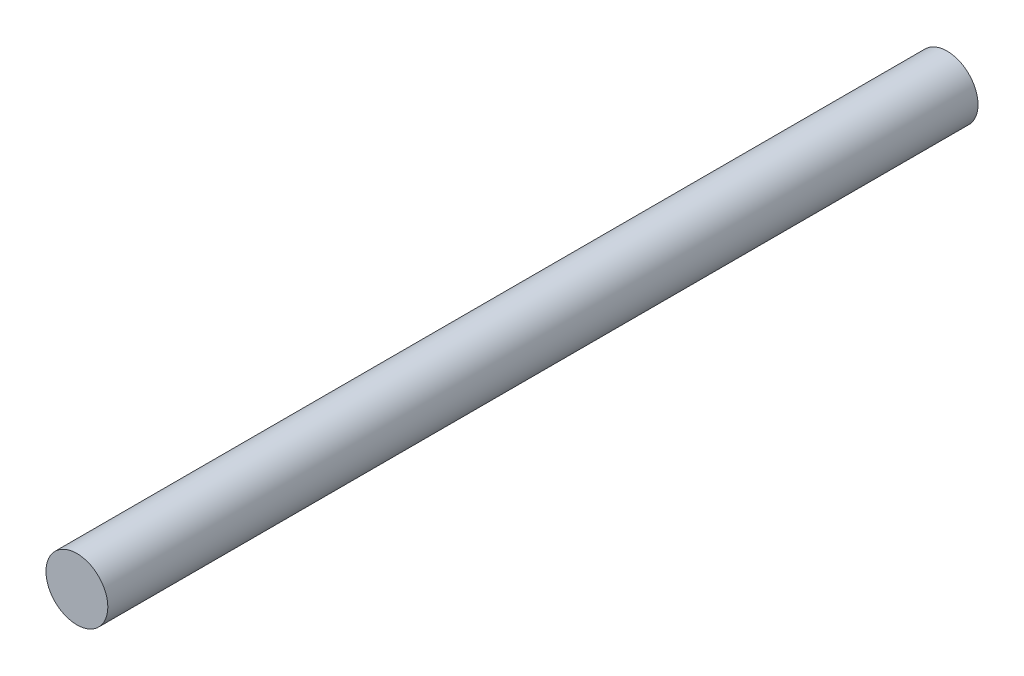
ISO-10303-21;
HEADER;
FILE_DESCRIPTION(('STEP AP214'),'2;1');
FILE_NAME('part.step','',(''),(''),'','','');
FILE_SCHEMA(('AUTOMOTIVE_DESIGN { 1 0 10303 214 1 1 1 1 }'));
ENDSEC;
DATA;
#1=APPLICATION_CONTEXT('core data for automotive mechanical design processes');
#2=APPLICATION_PROTOCOL_DEFINITION('international standard','automotive_design',2000,#1);
#3=PRODUCT_CONTEXT('',#1,'mechanical');
#4=PRODUCT('Part','Part','',(#3));
#5=PRODUCT_RELATED_PRODUCT_CATEGORY('part','',(#4));
#6=PRODUCT_DEFINITION_FORMATION('','',#4);
#7=PRODUCT_DEFINITION_CONTEXT('part definition',#1,'design');
#8=PRODUCT_DEFINITION('design','',#6,#7);
#9=PRODUCT_DEFINITION_SHAPE('','',#8);
#10=(LENGTH_UNIT() NAMED_UNIT(*) SI_UNIT(.MILLI.,.METRE.));
#11=(NAMED_UNIT(*) PLANE_ANGLE_UNIT() SI_UNIT($,.RADIAN.));
#12=(NAMED_UNIT(*) SI_UNIT($,.STERADIAN.) SOLID_ANGLE_UNIT());
#13=UNCERTAINTY_MEASURE_WITH_UNIT(LENGTH_MEASURE(1.E-05),#10,'distance_accuracy_value','');
#14=(GEOMETRIC_REPRESENTATION_CONTEXT(3) GLOBAL_UNCERTAINTY_ASSIGNED_CONTEXT((#13)) GLOBAL_UNIT_ASSIGNED_CONTEXT((#10,
#11,#12)) REPRESENTATION_CONTEXT('',''));
#15=CARTESIAN_POINT('',(0.,0.,0.));
#16=DIRECTION('',(0.,0.,1.));
#17=DIRECTION('',(1.,0.,0.));
#18=AXIS2_PLACEMENT_3D('',#15,#16,#17);
#19=CARTESIAN_POINT('',(0.,0.,45.));
#20=DIRECTION('',(0.,0.,-1.));
#21=DIRECTION('',(-1.,0.,0.));
#22=AXIS2_PLACEMENT_3D('',#19,#20,#21);
#23=CYLINDRICAL_SURFACE('',#22,1.6);
#24=CARTESIAN_POINT('',(0.,0.,45.));
#25=DIRECTION('',(0.,0.,1.));
#26=DIRECTION('',(1.,0.,0.));
#27=AXIS2_PLACEMENT_3D('',#24,#25,#26);
#28=CIRCLE('',#27,1.6);
#29=CARTESIAN_POINT('',(1.6,0.,45.));
#30=VERTEX_POINT('',#29);
#31=EDGE_CURVE('E10',#30,#30,#28,.T.);
#32=ORIENTED_EDGE('',*,*,#31,.F.);
#33=EDGE_LOOP('',(#32));
#34=FACE_BOUND('',#33,.T.);
#35=CARTESIAN_POINT('',(0.,0.,0.));
#36=DIRECTION('',(0.,0.,1.));
#37=DIRECTION('',(1.,0.,0.));
#38=AXIS2_PLACEMENT_3D('',#35,#36,#37);
#39=CIRCLE('',#38,1.6);
#40=CARTESIAN_POINT('',(1.6,0.,0.));
#41=VERTEX_POINT('',#40);
#42=EDGE_CURVE('E34',#41,#41,#39,.T.);
#43=ORIENTED_EDGE('',*,*,#42,.T.);
#44=EDGE_LOOP('',(#43));
#45=FACE_BOUND('',#44,.T.);
#46=ADVANCED_FACE('F31',(#34,#45),#23,.T.);
#47=CARTESIAN_POINT('',(0.,0.,45.));
#48=DIRECTION('',(0.,0.,1.));
#49=DIRECTION('',(1.,0.,0.));
#50=AXIS2_PLACEMENT_3D('',#47,#48,#49);
#51=PLANE('',#50);
#52=ORIENTED_EDGE('',*,*,#31,.T.);
#53=EDGE_LOOP('',(#52));
#54=FACE_BOUND('',#53,.T.);
#55=ADVANCED_FACE('F46',(#54),#51,.T.);
#56=CARTESIAN_POINT('',(0.,0.,0.));
#57=DIRECTION('',(0.,0.,1.));
#58=DIRECTION('',(1.,0.,0.));
#59=AXIS2_PLACEMENT_3D('',#56,#57,#58);
#60=PLANE('',#59);
#61=ORIENTED_EDGE('',*,*,#42,.F.);
#62=EDGE_LOOP('',(#61));
#63=FACE_BOUND('',#62,.T.);
#64=ADVANCED_FACE('F44',(#63),#60,.F.);
#65=CLOSED_SHELL('',(#46,#55,#64));
#66=MANIFOLD_SOLID_BREP('B2',#65);
#67=ADVANCED_BREP_SHAPE_REPRESENTATION('',(#18,#66),#14);
#68=SHAPE_DEFINITION_REPRESENTATION(#9,#67);
ENDSEC;
END-ISO-10303-21;
